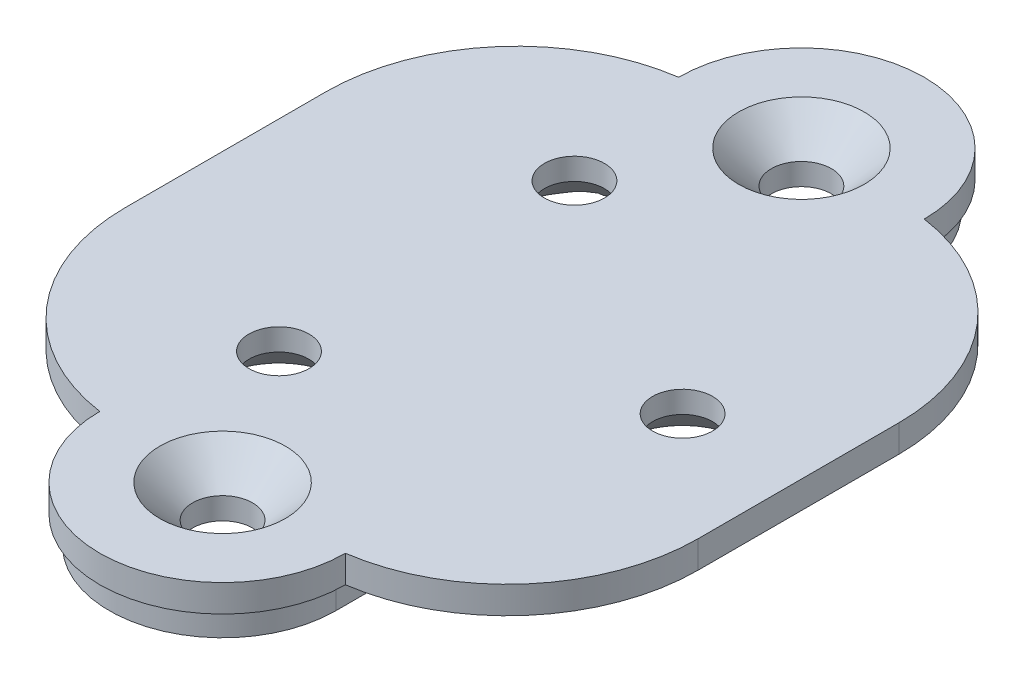
ISO-10303-21;
HEADER;
FILE_DESCRIPTION(('STEP AP214'),'2;1');
FILE_NAME('part.step','',(''),(''),'','','');
FILE_SCHEMA(('AUTOMOTIVE_DESIGN { 1 0 10303 214 1 1 1 1 }'));
ENDSEC;
DATA;
#1=APPLICATION_CONTEXT('core data for automotive mechanical design processes');
#2=APPLICATION_PROTOCOL_DEFINITION('international standard','automotive_design',2000,#1);
#3=PRODUCT_CONTEXT('',#1,'mechanical');
#4=PRODUCT('Part','Part','',(#3));
#5=PRODUCT_RELATED_PRODUCT_CATEGORY('part','',(#4));
#6=PRODUCT_DEFINITION_FORMATION('','',#4);
#7=PRODUCT_DEFINITION_CONTEXT('part definition',#1,'design');
#8=PRODUCT_DEFINITION('design','',#6,#7);
#9=PRODUCT_DEFINITION_SHAPE('','',#8);
#10=(LENGTH_UNIT() NAMED_UNIT(*) SI_UNIT(.MILLI.,.METRE.));
#11=(NAMED_UNIT(*) PLANE_ANGLE_UNIT() SI_UNIT($,.RADIAN.));
#12=(NAMED_UNIT(*) SI_UNIT($,.STERADIAN.) SOLID_ANGLE_UNIT());
#13=UNCERTAINTY_MEASURE_WITH_UNIT(LENGTH_MEASURE(1.E-05),#10,'distance_accuracy_value','');
#14=(GEOMETRIC_REPRESENTATION_CONTEXT(3) GLOBAL_UNCERTAINTY_ASSIGNED_CONTEXT((#13)) GLOBAL_UNIT_ASSIGNED_CONTEXT((#10,
#11,#12)) REPRESENTATION_CONTEXT('',''));
#15=CARTESIAN_POINT('',(0.,0.,0.));
#16=DIRECTION('',(0.,0.,1.));
#17=DIRECTION('',(1.,0.,0.));
#18=AXIS2_PLACEMENT_3D('',#15,#16,#17);
#19=CARTESIAN_POINT('',(0.,0.,0.));
#20=DIRECTION('',(0.,1.,0.));
#21=DIRECTION('',(0.,0.,1.));
#22=AXIS2_PLACEMENT_3D('',#19,#20,#21);
#23=PLANE('',#22);
#24=CARTESIAN_POINT('',(0.,0.,10.6041655099018));
#25=DIRECTION('',(0.,1.,0.));
#26=DIRECTION('',(0.,0.,1.));
#27=AXIS2_PLACEMENT_3D('',#24,#25,#26);
#28=CIRCLE('',#27,1.1);
#29=CARTESIAN_POINT('',(0.,0.,11.7041655099018));
#30=VERTEX_POINT('',#29);
#31=EDGE_CURVE('E382',#30,#30,#28,.T.);
#32=ORIENTED_EDGE('',*,*,#31,.T.);
#33=EDGE_LOOP('',(#32));
#34=FACE_BOUND('',#33,.T.);
#35=CARTESIAN_POINT('',(0.,0.,-10.6041655099018));
#36=DIRECTION('',(0.,1.,0.));
#37=DIRECTION('',(0.,0.,1.));
#38=AXIS2_PLACEMENT_3D('',#35,#36,#37);
#39=CIRCLE('',#38,1.1);
#40=CARTESIAN_POINT('',(0.,0.,-9.50416550990182));
#41=VERTEX_POINT('',#40);
#42=EDGE_CURVE('E390',#41,#41,#39,.T.);
#43=ORIENTED_EDGE('',*,*,#42,.T.);
#44=EDGE_LOOP('',(#43));
#45=FACE_BOUND('',#44,.T.);
#46=CARTESIAN_POINT('',(0.,0.,0.));
#47=DIRECTION('',(0.,-1.,0.));
#48=DIRECTION('',(0.,0.,-1.));
#49=AXIS2_PLACEMENT_3D('',#46,#47,#48);
#50=CIRCLE('',#49,8.4);
#51=CARTESIAN_POINT('',(4.15,0.,-7.30325269999608));
#52=VERTEX_POINT('',#51);
#53=CARTESIAN_POINT('',(8.3466,0.,-0.945657675906018));
#54=VERTEX_POINT('',#53);
#55=EDGE_CURVE('E194',#52,#54,#50,.T.);
#56=ORIENTED_EDGE('',*,*,#55,.T.);
#57=CARTESIAN_POINT('',(6.25,0.,0.));
#58=DIRECTION('',(0.,-1.,0.));
#59=DIRECTION('',(0.,0.,-1.));
#60=AXIS2_PLACEMENT_3D('',#57,#58,#59);
#61=CIRCLE('',#60,2.3);
#62=CARTESIAN_POINT('',(8.34660000000001,0.,0.945657675906021));
#63=VERTEX_POINT('',#62);
#64=EDGE_CURVE('E423',#63,#54,#61,.T.);
#65=ORIENTED_EDGE('',*,*,#64,.F.);
#66=CARTESIAN_POINT('',(4.15,0.,7.30325269999608));
#67=VERTEX_POINT('',#66);
#68=EDGE_CURVE('E53',#63,#67,#50,.T.);
#69=ORIENTED_EDGE('',*,*,#68,.T.);
#70=DIRECTION('',(0.,0.,1.));
#71=VECTOR('',#70,1.);
#72=CARTESIAN_POINT('',(4.15,0.,7.30325269999608));
#73=LINE('',#72,#71);
#74=CARTESIAN_POINT('',(4.15,0.,10.6041655099018));
#75=VERTEX_POINT('',#74);
#76=EDGE_CURVE('E174',#67,#75,#73,.T.);
#77=ORIENTED_EDGE('',*,*,#76,.T.);
#78=CARTESIAN_POINT('',(0.,0.,10.6041655099018));
#79=DIRECTION('',(0.,-1.,0.));
#80=DIRECTION('',(0.,0.,-1.));
#81=AXIS2_PLACEMENT_3D('',#78,#79,#80);
#82=CIRCLE('',#81,4.15);
#83=CARTESIAN_POINT('',(-4.15,0.,10.6041655099018));
#84=VERTEX_POINT('',#83);
#85=EDGE_CURVE('E176',#75,#84,#82,.T.);
#86=ORIENTED_EDGE('',*,*,#85,.T.);
#87=DIRECTION('',(0.,0.,-1.));
#88=VECTOR('',#87,1.);
#89=CARTESIAN_POINT('',(-4.15,0.,10.6041655099018));
#90=LINE('',#89,#88);
#91=CARTESIAN_POINT('',(-4.15,0.,7.47163303284104));
#92=VERTEX_POINT('',#91);
#93=EDGE_CURVE('E232',#84,#92,#90,.T.);
#94=ORIENTED_EDGE('',*,*,#93,.T.);
#95=CARTESIAN_POINT('',(-3.12499999999999,0.,5.41265877365275));
#96=DIRECTION('',(0.,-1.,0.));
#97=DIRECTION('',(0.,0.,-1.));
#98=AXIS2_PLACEMENT_3D('',#95,#96,#97);
#99=CIRCLE('',#98,2.3);
#100=CARTESIAN_POINT('',(-4.99226357061835,0.,6.7555387972742));
#101=VERTEX_POINT('',#100);
#102=EDGE_CURVE('E405',#101,#92,#99,.T.);
#103=ORIENTED_EDGE('',*,*,#102,.F.);
#104=CARTESIAN_POINT('',(0.,0.,0.));
#105=DIRECTION('',(0.,-1.,0.));
#106=DIRECTION('',(0.,0.,-1.));
#107=AXIS2_PLACEMENT_3D('',#104,#105,#106);
#108=CIRCLE('',#107,8.4);
#109=CARTESIAN_POINT('',(-4.99226357061835,0.,-6.7555387972742));
#110=VERTEX_POINT('',#109);
#111=EDGE_CURVE('E229',#101,#110,#108,.T.);
#112=ORIENTED_EDGE('',*,*,#111,.T.);
#113=CARTESIAN_POINT('',(-3.12499999999999,0.,-5.41265877365275));
#114=DIRECTION('',(0.,-1.,0.));
#115=DIRECTION('',(0.,0.,-1.));
#116=AXIS2_PLACEMENT_3D('',#113,#114,#115);
#117=CIRCLE('',#116,2.3);
#118=CARTESIAN_POINT('',(-4.15,0.,-7.47163303284104));
#119=VERTEX_POINT('',#118);
#120=EDGE_CURVE('E414',#119,#110,#117,.T.);
#121=ORIENTED_EDGE('',*,*,#120,.F.);
#122=DIRECTION('',(0.,0.,-1.));
#123=VECTOR('',#122,1.);
#124=CARTESIAN_POINT('',(-4.15,0.,-7.30325269999608));
#125=LINE('',#124,#123);
#126=CARTESIAN_POINT('',(-4.15,0.,-10.6041655099018));
#127=VERTEX_POINT('',#126);
#128=EDGE_CURVE('E225',#119,#127,#125,.T.);
#129=ORIENTED_EDGE('',*,*,#128,.T.);
#130=CARTESIAN_POINT('',(0.,0.,-10.6041655099018));
#131=DIRECTION('',(0.,-1.,0.));
#132=DIRECTION('',(0.,0.,-1.));
#133=AXIS2_PLACEMENT_3D('',#130,#131,#132);
#134=CIRCLE('',#133,4.15);
#135=CARTESIAN_POINT('',(4.15,0.,-10.6041655099018));
#136=VERTEX_POINT('',#135);
#137=EDGE_CURVE('E221',#127,#136,#134,.T.);
#138=ORIENTED_EDGE('',*,*,#137,.T.);
#139=DIRECTION('',(0.,0.,1.));
#140=VECTOR('',#139,1.);
#141=CARTESIAN_POINT('',(4.15,0.,-10.6041655099018));
#142=LINE('',#141,#140);
#143=EDGE_CURVE('E218',#136,#52,#142,.T.);
#144=ORIENTED_EDGE('',*,*,#143,.T.);
#145=EDGE_LOOP('',(#56,#65,#69,#77,#86,#94,#103,#112,#121,#129,#138,#144));
#146=FACE_BOUND('',#145,.T.);
#147=ADVANCED_FACE('F33',(#34,#45,#146),#23,.F.);
#148=CARTESIAN_POINT('',(-3.12499999999999,0.,5.41265877365275));
#149=DIRECTION('',(0.,-1.,0.));
#150=DIRECTION('',(0.,0.,-1.));
#151=AXIS2_PLACEMENT_3D('',#148,#149,#150);
#152=CONICAL_SURFACE('',#151,2.3,0.785398163397455);
#153=CARTESIAN_POINT('',(-3.12499999999999,1.19999999999999,5.41265877365275));
#154=DIRECTION('',(0.,-1.,0.));
#155=DIRECTION('',(0.,0.,-1.));
#156=AXIS2_PLACEMENT_3D('',#153,#154,#155);
#157=CIRCLE('',#156,1.09999999999999);
#158=CARTESIAN_POINT('',(-3.12499999999999,1.19999999999999,4.31265877365276));
#159=VERTEX_POINT('',#158);
#160=EDGE_CURVE('E402',#159,#159,#157,.T.);
#161=ORIENTED_EDGE('',*,*,#160,.F.);
#162=EDGE_LOOP('',(#161));
#163=FACE_BOUND('',#162,.T.);
#164=CARTESIAN_POINT('',(-4.99278917763485,-0.000200000000061499,6.75515034826704));
#165=CARTESIAN_POINT('',(-4.92715198670171,0.0248100631838858,6.80367058612201));
#166=CARTESIAN_POINT('',(-4.86011425174692,0.0472295339260996,6.85173200169083));
#167=CARTESIAN_POINT('',(-4.72397796758234,0.0858821322138904,6.94628151619377));
#168=CARTESIAN_POINT('',(-4.65489792935854,0.102159021983192,6.99277850884145));
#169=CARTESIAN_POINT('',(-4.5143933624049,0.127920925551719,7.08429850334942));
#170=CARTESIAN_POINT('',(-4.44296678533144,0.13739983112156,7.12932014498418));
#171=CARTESIAN_POINT('',(-4.33425856189755,0.146116604762799,7.19555589053189));
#172=CARTESIAN_POINT('',(-4.29762174729584,0.148102261529235,7.21749758253535));
#173=CARTESIAN_POINT('',(-4.22397358602387,0.150184179206707,7.26084531213115));
#174=CARTESIAN_POINT('',(-4.18696219449155,0.150280211057864,7.28225128446958));
#175=CARTESIAN_POINT('',(-4.14979999999992,0.149420971471217,7.30336634436481));
#176=B_SPLINE_CURVE_WITH_KNOTS('',3,(#164,#165,#166,#167,#168,#169,#170,#171,#172,#173,#174,
#175),.UNSPECIFIED.,.F.,.F.,(4,2,2,2,2,4),(0.,0.256139644494165,0.5104183582001,
0.764925265041134,0.893136897085683,1.02136407081771),.UNSPECIFIED.);
#177=CARTESIAN_POINT('',(-4.15,0.149425566429672,7.30325269999608));
#178=VERTEX_POINT('',#177);
#179=EDGE_CURVE('E200',#101,#178,#176,.T.);
#180=ORIENTED_EDGE('',*,*,#179,.F.);
#181=ORIENTED_EDGE('',*,*,#102,.T.);
#182=CARTESIAN_POINT('',(-4.15,0.868212410657697,6.41235407773023));
#183=CARTESIAN_POINT('',(-4.15,0.838635516505296,6.45468745235044));
#184=CARTESIAN_POINT('',(-4.15,0.808442067134203,6.49658092804831));
#185=CARTESIAN_POINT('',(-4.15,0.747058812831585,6.57961975471023));
#186=CARTESIAN_POINT('',(-4.15,0.715869210071513,6.62076525485086));
#187=CARTESIAN_POINT('',(-4.15,0.65273762083587,6.70243175693539));
#188=CARTESIAN_POINT('',(-4.15,0.620796106722267,6.74295312582206));
#189=CARTESIAN_POINT('',(-4.15,0.556291415118948,6.82350101667112));
#190=CARTESIAN_POINT('',(-4.15,0.523728201471161,6.86352750962707));
#191=CARTESIAN_POINT('',(-4.15,0.425360384583194,6.98291108139938));
#192=CARTESIAN_POINT('',(-4.15,0.35881253934147,7.06165535963236));
#193=CARTESIAN_POINT('',(-4.15,0.224358529488972,7.21799492669198));
#194=CARTESIAN_POINT('',(-4.15,0.156452102870568,7.2955899887673));
#195=CARTESIAN_POINT('',(-4.15,-0.0317357135467273,7.50797094387607));
#196=CARTESIAN_POINT('',(-4.15,-0.153001253049908,7.64188346556477));
#197=CARTESIAN_POINT('',(-4.15,-0.397250150436154,7.90811285690661));
#198=CARTESIAN_POINT('',(-4.15,-0.520233443537888,8.04042978638523));
#199=CARTESIAN_POINT('',(-4.15,-0.767513488372292,8.30422322777691));
#200=CARTESIAN_POINT('',(-4.15,-0.891812012622755,8.43569807569894));
#201=CARTESIAN_POINT('',(-4.15,-1.14119359432511,8.69788891918938));
#202=CARTESIAN_POINT('',(-4.15,-1.26627660974399,8.82860495470442));
#203=CARTESIAN_POINT('',(-4.15,-1.39159014935979,8.95909541214642));
#204=B_SPLINE_CURVE_WITH_KNOTS('',3,(#182,#183,#184,#185,#186,#187,#188,#189,#190,#191,#192,
#193,#194,#195,#196,#197,#198,#199,#200,#201,#202,#203),.UNSPECIFIED.,.F.,.F.,(4,2,2,2,2,2,2,2,
2,2,4),(0.,0.15490998689401,0.309788731795426,0.464572647559042,0.619365593151983,
0.928634945756171,1.2379645283185,1.7799128585347,2.32184080524199,2.86462750096266,
3.40738535849262),.UNSPECIFIED.);
#205=EDGE_CURVE('E11',#178,#92,#204,.T.);
#206=ORIENTED_EDGE('',*,*,#205,.F.);
#207=EDGE_LOOP('',(#180,#181,#206));
#208=FACE_BOUND('',#207,.T.);
#209=ADVANCED_FACE('F243',(#163,#208),#152,.F.);
#210=CARTESIAN_POINT('',(-3.12499999999999,0.,-5.41265877365275));
#211=DIRECTION('',(0.,-1.,0.));
#212=DIRECTION('',(0.,0.,-1.));
#213=AXIS2_PLACEMENT_3D('',#210,#211,#212);
#214=CONICAL_SURFACE('',#213,2.3,0.785398163397455);
#215=CARTESIAN_POINT('',(-3.12499999999999,1.19999999999999,-5.41265877365275));
#216=DIRECTION('',(0.,-1.,0.));
#217=DIRECTION('',(0.,0.,-1.));
#218=AXIS2_PLACEMENT_3D('',#215,#216,#217);
#219=CIRCLE('',#218,1.09999999999999);
#220=CARTESIAN_POINT('',(-3.12499999999999,1.19999999999999,-6.51265877365274));
#221=VERTEX_POINT('',#220);
#222=EDGE_CURVE('E411',#221,#221,#219,.T.);
#223=ORIENTED_EDGE('',*,*,#222,.F.);
#224=EDGE_LOOP('',(#223));
#225=FACE_BOUND('',#224,.T.);
#226=CARTESIAN_POINT('',(-4.15,-1.39159014935979,-8.95909541214643));
#227=CARTESIAN_POINT('',(-4.15,-1.26627660974399,-8.82860495470442));
#228=CARTESIAN_POINT('',(-4.15,-1.14119359432511,-8.69788891918939));
#229=CARTESIAN_POINT('',(-4.15,-0.891812012622754,-8.43569807569894));
#230=CARTESIAN_POINT('',(-4.15,-0.767513488372291,-8.30422322777692));
#231=CARTESIAN_POINT('',(-4.15,-0.520233443537887,-8.04042978638523));
#232=CARTESIAN_POINT('',(-4.15,-0.397250150436153,-7.90811285690661));
#233=CARTESIAN_POINT('',(-4.15,-0.153001253049907,-7.64188346556477));
#234=CARTESIAN_POINT('',(-4.15,-0.0317357135467267,-7.50797094387607));
#235=CARTESIAN_POINT('',(-4.15,0.156452102870568,-7.2955899887673));
#236=CARTESIAN_POINT('',(-4.15,0.224358529488972,-7.21799492669198));
#237=CARTESIAN_POINT('',(-4.15,0.358812539341468,-7.06165535963237));
#238=CARTESIAN_POINT('',(-4.15,0.425360384583191,-6.98291108139939));
#239=CARTESIAN_POINT('',(-4.15,0.523728201471157,-6.86352750962708));
#240=CARTESIAN_POINT('',(-4.15,0.556291415118944,-6.82350101667113));
#241=CARTESIAN_POINT('',(-4.15,0.620796106722262,-6.74295312582207));
#242=CARTESIAN_POINT('',(-4.15,0.652737620835865,-6.70243175693539));
#243=CARTESIAN_POINT('',(-4.15,0.715869210071508,-6.62076525485087));
#244=CARTESIAN_POINT('',(-4.15,0.74705881283158,-6.57961975471023));
#245=CARTESIAN_POINT('',(-4.15,0.808442067134197,-6.49658092804832));
#246=CARTESIAN_POINT('',(-4.15,0.83863551650529,-6.45468745235045));
#247=CARTESIAN_POINT('',(-4.15,0.868212410657691,-6.41235407773024));
#248=B_SPLINE_CURVE_WITH_KNOTS('',3,(#226,#227,#228,#229,#230,#231,#232,#233,#234,#235,#236,
#237,#238,#239,#240,#241,#242,#243,#244,#245,#246,#247),.UNSPECIFIED.,.F.,.F.,(4,2,2,2,2,2,2,2,
2,2,4),(0.,0.542757857529956,1.08554455325062,1.62747249995792,2.16942083017412,
2.47875041273644,2.78801976534063,2.94281271093357,3.09759662669718,3.2524753715986,
3.40738535849261),.UNSPECIFIED.);
#249=CARTESIAN_POINT('',(-4.15,0.149425566429673,-7.30325269999608));
#250=VERTEX_POINT('',#249);
#251=EDGE_CURVE('E46',#119,#250,#248,.T.);
#252=ORIENTED_EDGE('',*,*,#251,.F.);
#253=ORIENTED_EDGE('',*,*,#120,.T.);
#254=CARTESIAN_POINT('',(-4.14979999999992,0.149420971471218,-7.30336634436482));
#255=CARTESIAN_POINT('',(-4.18696219449155,0.150280211057864,-7.28225128446958));
#256=CARTESIAN_POINT('',(-4.22397358602387,0.150184179206707,-7.26084531213115));
#257=CARTESIAN_POINT('',(-4.29762174729584,0.148102261529237,-7.21749758253535));
#258=CARTESIAN_POINT('',(-4.33425856189755,0.146116604762801,-7.19555589053189));
#259=CARTESIAN_POINT('',(-4.44296678533143,0.137399831121562,-7.12932014498418));
#260=CARTESIAN_POINT('',(-4.5143933624049,0.12792092555172,-7.08429850334943));
#261=CARTESIAN_POINT('',(-4.65489792935854,0.102159021983192,-6.99277850884145));
#262=CARTESIAN_POINT('',(-4.72397796758234,0.0858821322138897,-6.94628151619377));
#263=CARTESIAN_POINT('',(-4.86011425174692,0.0472295339260988,-6.85173200169083));
#264=CARTESIAN_POINT('',(-4.92715198670171,0.0248100631838853,-6.80367058612201));
#265=CARTESIAN_POINT('',(-4.99278917763485,-0.000200000000061046,-6.75515034826704));
#266=B_SPLINE_CURVE_WITH_KNOTS('',3,(#254,#255,#256,#257,#258,#259,#260,#261,#262,#263,#264,
#265),.UNSPECIFIED.,.F.,.F.,(4,2,2,2,2,4),(0.,0.128227173732023,0.256438805776574,
0.510945712617607,0.765224426323541,1.02136407081771),.UNSPECIFIED.);
#267=EDGE_CURVE('E260',#250,#110,#266,.T.);
#268=ORIENTED_EDGE('',*,*,#267,.F.);
#269=EDGE_LOOP('',(#252,#253,#268));
#270=FACE_BOUND('',#269,.T.);
#271=ADVANCED_FACE('F276',(#225,#270),#214,.F.);
#272=CARTESIAN_POINT('',(6.25,0.,0.));
#273=DIRECTION('',(0.,-1.,0.));
#274=DIRECTION('',(0.,0.,-1.));
#275=AXIS2_PLACEMENT_3D('',#272,#273,#274);
#276=CONICAL_SURFACE('',#275,2.3,0.785398163397455);
#277=CARTESIAN_POINT('',(6.25,1.19999999999999,0.));
#278=DIRECTION('',(0.,-1.,0.));
#279=DIRECTION('',(0.,0.,-1.));
#280=AXIS2_PLACEMENT_3D('',#277,#278,#279);
#281=CIRCLE('',#280,1.09999999999999);
#282=CARTESIAN_POINT('',(6.25,1.19999999999999,-1.09999999999999));
#283=VERTEX_POINT('',#282);
#284=EDGE_CURVE('E420',#283,#283,#281,.T.);
#285=ORIENTED_EDGE('',*,*,#284,.F.);
#286=EDGE_LOOP('',(#285));
#287=FACE_BOUND('',#286,.T.);
#288=CARTESIAN_POINT('',(7.99940268198013,-0.803218728231761,2.56311465438617));
#289=CARTESIAN_POINT('',(8.01901973062119,-0.763712098221157,2.50188639853172));
#290=CARTESIAN_POINT('',(8.03802420179341,-0.724678367905175,2.44015925728474));
#291=CARTESIAN_POINT('',(8.07478411273328,-0.647740918936234,2.31561704365371));
#292=CARTESIAN_POINT('',(8.0925392496951,-0.609837475509088,2.25280171208696));
#293=CARTESIAN_POINT('',(8.14406168867552,-0.497734337328274,2.06196372954792));
#294=CARTESIAN_POINT('',(8.17587822807902,-0.425563112680702,1.93219388866401));
#295=CARTESIAN_POINT('',(8.23484419992085,-0.286869780285497,1.66338772474935));
#296=CARTESIAN_POINT('',(8.26182281385857,-0.220585396385035,1.52418972641715));
#297=CARTESIAN_POINT('',(8.30925198461296,-0.100098504213216,1.23977125402815));
#298=CARTESIAN_POINT('',(8.32971728446831,-0.0458687950996659,1.09456523410996));
#299=CARTESIAN_POINT('',(8.35619604372874,0.0260715315098679,0.861019783065302));
#300=CARTESIAN_POINT('',(8.36465576095872,0.049510028869555,0.774722447430933));
#301=CARTESIAN_POINT('',(8.37897689492112,0.0896398723889784,0.600328637566321));
#302=CARTESIAN_POINT('',(8.38483832503197,0.106331253289116,0.512232172602115));
#303=CARTESIAN_POINT('',(8.39374821804879,0.131864489927603,0.335726896814049));
#304=CARTESIAN_POINT('',(8.39682643835329,0.140789343793036,0.247331785271671));
#305=CARTESIAN_POINT('',(8.40017545074915,0.150504032227429,0.0700442376169418));
#306=CARTESIAN_POINT('',(8.40044678609277,0.151295440965615,-0.0188480989287381));
#307=CARTESIAN_POINT('',(8.39840064041202,0.14535506851692,-0.178711387133715));
#308=CARTESIAN_POINT('',(8.39658479846534,0.140080954340669,-0.249747989194564));
#309=CARTESIAN_POINT('',(8.39118408612384,0.124509274329148,-0.391201211293811));
#310=CARTESIAN_POINT('',(8.38759911600649,0.11421142531544,-0.461617796155195));
#311=CARTESIAN_POINT('',(8.37871218577833,0.0889468167242237,-0.601775555188137));
#312=CARTESIAN_POINT('',(8.37340354318281,0.0739618943173351,-0.671512994631882));
#313=CARTESIAN_POINT('',(8.36116150526844,0.0398511067983217,-0.809815004097171));
#314=CARTESIAN_POINT('',(8.3542279444039,0.0207248197816066,-0.878379453851045));
#315=CARTESIAN_POINT('',(8.33041894048237,-0.0439633626280181,-1.08837482429491));
#316=CARTESIAN_POINT('',(8.31095216213957,-0.0955938542316042,-1.22765701124195));
#317=CARTESIAN_POINT('',(8.26604129807372,-0.21003184466273,-1.50058197251466));
#318=CARTESIAN_POINT('',(8.2405893488314,-0.272854020951852,-1.63421705263638));
#319=CARTESIAN_POINT('',(8.18414493921036,-0.406506062786883,-1.89680315916593));
#320=CARTESIAN_POINT('',(8.1531322575439,-0.47736479515948,-2.02573495106415));
#321=CARTESIAN_POINT('',(8.08600911070525,-0.624517858480624,-2.27894710953865));
#322=CARTESIAN_POINT('',(8.04990151960078,-0.700809112975062,-2.40323004889502));
#323=CARTESIAN_POINT('',(7.97766939526602,-0.847428445300692,-2.63236622193731));
#324=CARTESIAN_POINT('',(7.94211867166273,-0.917298965629626,-2.73769652692426));
#325=CARTESIAN_POINT('',(7.86769230566879,-1.0587732024576,-2.94472181029001));
#326=CARTESIAN_POINT('',(7.82884396551999,-1.13035972580474,-3.04643832245323));
#327=CARTESIAN_POINT('',(7.78827247654394,-1.20272665836211,-3.14687334208228));
#328=B_SPLINE_CURVE_WITH_KNOTS('',3,(#288,#289,#290,#291,#292,#293,#294,#295,#296,#297,#298,
#299,#300,#301,#302,#303,#304,#305,#306,#307,#308,#309,#310,#311,#312,#313,#314,#315,#316,#317,
#318,#319,#320,#321,#322,#323,#324,#325,#326,#327),.UNSPECIFIED.,.F.,.F.,(4,2,2,2,2,2,2,2,2,2,2,
2,2,2,2,2,2,2,2,4),(0.,0.226373642691225,0.452801964757162,0.908048674976562,1.37710279906582,
1.84508752998397,2.11430145554731,2.38351399493048,2.64981292249666,2.91606030886885,
3.12962388177167,3.34319949424071,3.55761320479847,3.77204876919797,4.22053155008237,
4.6696068877125,5.12034966387739,5.57083918247501,5.96464461993724,6.35545922993768),.UNSPECIFIED.);
#329=EDGE_CURVE('E266',#63,#54,#328,.T.);
#330=ORIENTED_EDGE('',*,*,#329,.F.);
#331=ORIENTED_EDGE('',*,*,#64,.T.);
#332=EDGE_LOOP('',(#330,#331));
#333=FACE_BOUND('',#332,.T.);
#334=ADVANCED_FACE('F280',(#287,#333),#276,.F.);
#335=CARTESIAN_POINT('',(0.,2.,-10.6041655099018));
#336=DIRECTION('',(0.,-1.,0.));
#337=DIRECTION('',(0.,0.,-1.));
#338=AXIS2_PLACEMENT_3D('',#335,#336,#337);
#339=CYLINDRICAL_SURFACE('',#338,4.5);
#340=DIRECTION('',(0.,-1.,0.));
#341=VECTOR('',#340,1.);
#342=CARTESIAN_POINT('',(4.5,2.,-10.6041655099018));
#343=LINE('',#342,#341);
#344=CARTESIAN_POINT('',(4.5,2.,-10.6041655099018));
#345=VERTEX_POINT('',#344);
#346=CARTESIAN_POINT('',(4.5,1.,-10.6041655099018));
#347=VERTEX_POINT('',#346);
#348=EDGE_CURVE('E366',#345,#347,#343,.T.);
#349=ORIENTED_EDGE('',*,*,#348,.T.);
#350=CARTESIAN_POINT('',(0.,1.,-10.6041655099018));
#351=DIRECTION('',(0.,1.,0.));
#352=DIRECTION('',(0.,0.,1.));
#353=AXIS2_PLACEMENT_3D('',#350,#351,#352);
#354=CIRCLE('',#353,4.5);
#355=CARTESIAN_POINT('',(-4.5,1.,-10.6041655099018));
#356=VERTEX_POINT('',#355);
#357=EDGE_CURVE('E211',#356,#347,#354,.F.);
#358=ORIENTED_EDGE('',*,*,#357,.F.);
#359=DIRECTION('',(0.,-1.,0.));
#360=VECTOR('',#359,1.);
#361=CARTESIAN_POINT('',(-4.5,2.,-10.6041655099018));
#362=LINE('',#361,#360);
#363=CARTESIAN_POINT('',(-4.5,2.,-10.6041655099018));
#364=VERTEX_POINT('',#363);
#365=EDGE_CURVE('E369',#364,#356,#362,.T.);
#366=ORIENTED_EDGE('',*,*,#365,.F.);
#367=CARTESIAN_POINT('',(0.,2.,-10.6041655099018));
#368=DIRECTION('',(0.,1.,0.));
#369=DIRECTION('',(0.,0.,1.));
#370=AXIS2_PLACEMENT_3D('',#367,#368,#369);
#371=CIRCLE('',#370,4.5);
#372=EDGE_CURVE('E379',#345,#364,#371,.T.);
#373=ORIENTED_EDGE('',*,*,#372,.F.);
#374=EDGE_LOOP('',(#349,#358,#366,#373));
#375=FACE_BOUND('',#374,.T.);
#376=ADVANCED_FACE('F314',(#375),#339,.T.);
#377=CARTESIAN_POINT('',(0.,2.,10.6041655099018));
#378=DIRECTION('',(0.,-1.,0.));
#379=DIRECTION('',(0.,0.,-1.));
#380=AXIS2_PLACEMENT_3D('',#377,#378,#379);
#381=CYLINDRICAL_SURFACE('',#380,4.5);
#382=DIRECTION('',(0.,-1.,0.));
#383=VECTOR('',#382,1.);
#384=CARTESIAN_POINT('',(-4.5,2.,10.6041655099018));
#385=LINE('',#384,#383);
#386=CARTESIAN_POINT('',(-4.5,2.,10.6041655099018));
#387=VERTEX_POINT('',#386);
#388=CARTESIAN_POINT('',(-4.5,1.,10.6041655099018));
#389=VERTEX_POINT('',#388);
#390=EDGE_CURVE('E372',#387,#389,#385,.T.);
#391=ORIENTED_EDGE('',*,*,#390,.T.);
#392=CARTESIAN_POINT('',(0.,1.,10.6041655099018));
#393=DIRECTION('',(0.,1.,0.));
#394=DIRECTION('',(0.,0.,1.));
#395=AXIS2_PLACEMENT_3D('',#392,#393,#394);
#396=CIRCLE('',#395,4.5);
#397=CARTESIAN_POINT('',(4.5,1.,10.6041655099018));
#398=VERTEX_POINT('',#397);
#399=EDGE_CURVE('E213',#398,#389,#396,.F.);
#400=ORIENTED_EDGE('',*,*,#399,.F.);
#401=DIRECTION('',(0.,-1.,0.));
#402=VECTOR('',#401,1.);
#403=CARTESIAN_POINT('',(4.5,2.,10.6041655099018));
#404=LINE('',#403,#402);
#405=CARTESIAN_POINT('',(4.5,2.,10.6041655099018));
#406=VERTEX_POINT('',#405);
#407=EDGE_CURVE('E341',#406,#398,#404,.T.);
#408=ORIENTED_EDGE('',*,*,#407,.F.);
#409=CARTESIAN_POINT('',(0.,2.,10.6041655099018));
#410=DIRECTION('',(0.,1.,0.));
#411=DIRECTION('',(0.,0.,1.));
#412=AXIS2_PLACEMENT_3D('',#409,#410,#411);
#413=CIRCLE('',#412,4.5);
#414=EDGE_CURVE('E376',#387,#406,#413,.T.);
#415=ORIENTED_EDGE('',*,*,#414,.F.);
#416=EDGE_LOOP('',(#391,#400,#408,#415));
#417=FACE_BOUND('',#416,.T.);
#418=ADVANCED_FACE('F311',(#417),#381,.T.);
#419=CARTESIAN_POINT('',(0.,2.,0.));
#420=DIRECTION('',(0.,1.,0.));
#421=DIRECTION('',(0.,0.,1.));
#422=AXIS2_PLACEMENT_3D('',#419,#420,#421);
#423=PLANE('',#422);
#424=ORIENTED_EDGE('',*,*,#372,.T.);
#425=CARTESIAN_POINT('',(-3.49999999999999,2.,-3.67596227962631));
#426=DIRECTION('',(0.,1.,0.));
#427=DIRECTION('',(0.,0.,1.));
#428=AXIS2_PLACEMENT_3D('',#425,#426,#427);
#429=CIRCLE('',#428,7.);
#430=CARTESIAN_POINT('',(-10.5,2.,-3.67596227962631));
#431=VERTEX_POINT('',#430);
#432=EDGE_CURVE('E358',#364,#431,#429,.T.);
#433=ORIENTED_EDGE('',*,*,#432,.T.);
#434=DIRECTION('',(0.,0.,1.));
#435=VECTOR('',#434,1.);
#436=CARTESIAN_POINT('',(-10.5,2.,-10.6041655099018));
#437=LINE('',#436,#435);
#438=CARTESIAN_POINT('',(-10.5,2.,3.67596227962631));
#439=VERTEX_POINT('',#438);
#440=EDGE_CURVE('E240',#431,#439,#437,.T.);
#441=ORIENTED_EDGE('',*,*,#440,.T.);
#442=CARTESIAN_POINT('',(-3.49999999999999,2.,3.67596227962631));
#443=DIRECTION('',(0.,1.,0.));
#444=DIRECTION('',(0.,0.,1.));
#445=AXIS2_PLACEMENT_3D('',#442,#443,#444);
#446=CIRCLE('',#445,7.);
#447=EDGE_CURVE('E360',#439,#387,#446,.T.);
#448=ORIENTED_EDGE('',*,*,#447,.T.);
#449=ORIENTED_EDGE('',*,*,#414,.T.);
#450=CARTESIAN_POINT('',(3.5,2.,3.67596227962631));
#451=DIRECTION('',(0.,1.,0.));
#452=DIRECTION('',(0.,0.,1.));
#453=AXIS2_PLACEMENT_3D('',#450,#451,#452);
#454=CIRCLE('',#453,7.);
#455=CARTESIAN_POINT('',(10.5,2.,3.67596227962631));
#456=VERTEX_POINT('',#455);
#457=EDGE_CURVE('E362',#406,#456,#454,.T.);
#458=ORIENTED_EDGE('',*,*,#457,.T.);
#459=DIRECTION('',(0.,0.,-1.));
#460=VECTOR('',#459,1.);
#461=CARTESIAN_POINT('',(10.5,2.,-10.6041655099018));
#462=LINE('',#461,#460);
#463=CARTESIAN_POINT('',(10.5,2.,-3.67596227962631));
#464=VERTEX_POINT('',#463);
#465=EDGE_CURVE('E427',#456,#464,#462,.T.);
#466=ORIENTED_EDGE('',*,*,#465,.T.);
#467=CARTESIAN_POINT('',(3.5,2.,-3.67596227962631));
#468=DIRECTION('',(0.,1.,0.));
#469=DIRECTION('',(0.,0.,1.));
#470=AXIS2_PLACEMENT_3D('',#467,#468,#469);
#471=CIRCLE('',#470,7.);
#472=EDGE_CURVE('E364',#464,#345,#471,.T.);
#473=ORIENTED_EDGE('',*,*,#472,.T.);
#474=EDGE_LOOP('',(#424,#433,#441,#448,#449,#458,#466,#473));
#475=FACE_BOUND('',#474,.T.);
#476=CARTESIAN_POINT('',(6.25,2.,0.));
#477=DIRECTION('',(0.,-1.,0.));
#478=DIRECTION('',(0.,0.,-1.));
#479=AXIS2_PLACEMENT_3D('',#476,#477,#478);
#480=CIRCLE('',#479,1.1);
#481=CARTESIAN_POINT('',(6.25,2.,-1.1));
#482=VERTEX_POINT('',#481);
#483=EDGE_CURVE('E417',#482,#482,#480,.T.);
#484=ORIENTED_EDGE('',*,*,#483,.T.);
#485=EDGE_LOOP('',(#484));
#486=FACE_BOUND('',#485,.T.);
#487=CARTESIAN_POINT('',(-3.12499999999999,2.,-5.41265877365275));
#488=DIRECTION('',(0.,-1.,0.));
#489=DIRECTION('',(0.,0.,-1.));
#490=AXIS2_PLACEMENT_3D('',#487,#488,#489);
#491=CIRCLE('',#490,1.1);
#492=CARTESIAN_POINT('',(-3.12499999999999,2.,-6.51265877365275));
#493=VERTEX_POINT('',#492);
#494=EDGE_CURVE('E408',#493,#493,#491,.T.);
#495=ORIENTED_EDGE('',*,*,#494,.T.);
#496=EDGE_LOOP('',(#495));
#497=FACE_BOUND('',#496,.T.);
#498=CARTESIAN_POINT('',(-3.12499999999999,2.,5.41265877365275));
#499=DIRECTION('',(0.,-1.,0.));
#500=DIRECTION('',(0.,0.,-1.));
#501=AXIS2_PLACEMENT_3D('',#498,#499,#500);
#502=CIRCLE('',#501,1.1);
#503=CARTESIAN_POINT('',(-3.12499999999999,2.,4.31265877365275));
#504=VERTEX_POINT('',#503);
#505=EDGE_CURVE('E399',#504,#504,#502,.T.);
#506=ORIENTED_EDGE('',*,*,#505,.T.);
#507=EDGE_LOOP('',(#506));
#508=FACE_BOUND('',#507,.T.);
#509=CARTESIAN_POINT('',(0.,2.,-10.6041655099018));
#510=DIRECTION('',(0.,1.,0.));
#511=DIRECTION('',(0.,0.,1.));
#512=AXIS2_PLACEMENT_3D('',#509,#510,#511);
#513=CIRCLE('',#512,2.3);
#514=CARTESIAN_POINT('',(0.,2.,-8.30416550990182));
#515=VERTEX_POINT('',#514);
#516=EDGE_CURVE('E396',#515,#515,#513,.T.);
#517=ORIENTED_EDGE('',*,*,#516,.F.);
#518=EDGE_LOOP('',(#517));
#519=FACE_BOUND('',#518,.T.);
#520=CARTESIAN_POINT('',(0.,2.,10.6041655099018));
#521=DIRECTION('',(0.,1.,0.));
#522=DIRECTION('',(0.,0.,1.));
#523=AXIS2_PLACEMENT_3D('',#520,#521,#522);
#524=CIRCLE('',#523,2.3);
#525=CARTESIAN_POINT('',(0.,2.,12.9041655099018));
#526=VERTEX_POINT('',#525);
#527=EDGE_CURVE('E387',#526,#526,#524,.T.);
#528=ORIENTED_EDGE('',*,*,#527,.F.);
#529=EDGE_LOOP('',(#528));
#530=FACE_BOUND('',#529,.T.);
#531=ADVANCED_FACE('F309',(#475,#486,#497,#508,#519,#530),#423,.T.);
#532=CARTESIAN_POINT('',(0.,2.,10.6041655099018));
#533=DIRECTION('',(0.,1.,0.));
#534=DIRECTION('',(0.,0.,1.));
#535=AXIS2_PLACEMENT_3D('',#532,#533,#534);
#536=CYLINDRICAL_SURFACE('',#535,1.1);
#537=ORIENTED_EDGE('',*,*,#31,.F.);
#538=EDGE_LOOP('',(#537));
#539=FACE_BOUND('',#538,.T.);
#540=CARTESIAN_POINT('',(0.,0.8,10.6041655099018));
#541=DIRECTION('',(0.,1.,0.));
#542=DIRECTION('',(0.,0.,1.));
#543=AXIS2_PLACEMENT_3D('',#540,#541,#542);
#544=CIRCLE('',#543,1.1);
#545=CARTESIAN_POINT('',(0.,0.8,11.7041655099018));
#546=VERTEX_POINT('',#545);
#547=EDGE_CURVE('E384',#546,#546,#544,.T.);
#548=ORIENTED_EDGE('',*,*,#547,.T.);
#549=EDGE_LOOP('',(#548));
#550=FACE_BOUND('',#549,.T.);
#551=ADVANCED_FACE('F602',(#539,#550),#536,.F.);
#552=CARTESIAN_POINT('',(0.,2.,10.6041655099018));
#553=DIRECTION('',(0.,1.,0.));
#554=DIRECTION('',(0.,0.,1.));
#555=AXIS2_PLACEMENT_3D('',#552,#553,#554);
#556=CONICAL_SURFACE('',#555,2.3,0.785398163397448);
#557=ORIENTED_EDGE('',*,*,#547,.F.);
#558=EDGE_LOOP('',(#557));
#559=FACE_BOUND('',#558,.T.);
#560=ORIENTED_EDGE('',*,*,#527,.T.);
#561=EDGE_LOOP('',(#560));
#562=FACE_BOUND('',#561,.T.);
#563=ADVANCED_FACE('F638',(#559,#562),#556,.F.);
#564=CARTESIAN_POINT('',(0.,2.,-10.6041655099018));
#565=DIRECTION('',(0.,1.,0.));
#566=DIRECTION('',(0.,0.,1.));
#567=AXIS2_PLACEMENT_3D('',#564,#565,#566);
#568=CYLINDRICAL_SURFACE('',#567,1.1);
#569=ORIENTED_EDGE('',*,*,#42,.F.);
#570=EDGE_LOOP('',(#569));
#571=FACE_BOUND('',#570,.T.);
#572=CARTESIAN_POINT('',(0.,0.8,-10.6041655099018));
#573=DIRECTION('',(0.,1.,0.));
#574=DIRECTION('',(0.,0.,1.));
#575=AXIS2_PLACEMENT_3D('',#572,#573,#574);
#576=CIRCLE('',#575,1.1);
#577=CARTESIAN_POINT('',(0.,0.8,-9.50416550990182));
#578=VERTEX_POINT('',#577);
#579=EDGE_CURVE('E393',#578,#578,#576,.T.);
#580=ORIENTED_EDGE('',*,*,#579,.T.);
#581=EDGE_LOOP('',(#580));
#582=FACE_BOUND('',#581,.T.);
#583=ADVANCED_FACE('F628',(#571,#582),#568,.F.);
#584=CARTESIAN_POINT('',(0.,2.,-10.6041655099018));
#585=DIRECTION('',(0.,1.,0.));
#586=DIRECTION('',(0.,0.,1.));
#587=AXIS2_PLACEMENT_3D('',#584,#585,#586);
#588=CONICAL_SURFACE('',#587,2.3,0.785398163397448);
#589=ORIENTED_EDGE('',*,*,#579,.F.);
#590=EDGE_LOOP('',(#589));
#591=FACE_BOUND('',#590,.T.);
#592=ORIENTED_EDGE('',*,*,#516,.T.);
#593=EDGE_LOOP('',(#592));
#594=FACE_BOUND('',#593,.T.);
#595=ADVANCED_FACE('F294',(#591,#594),#588,.F.);
#596=CARTESIAN_POINT('',(-3.12499999999999,0.,5.41265877365275));
#597=DIRECTION('',(0.,-1.,0.));
#598=DIRECTION('',(0.,0.,-1.));
#599=AXIS2_PLACEMENT_3D('',#596,#597,#598);
#600=CYLINDRICAL_SURFACE('',#599,1.09999999999999);
#601=ORIENTED_EDGE('',*,*,#505,.F.);
#602=EDGE_LOOP('',(#601));
#603=FACE_BOUND('',#602,.T.);
#604=ORIENTED_EDGE('',*,*,#160,.T.);
#605=EDGE_LOOP('',(#604));
#606=FACE_BOUND('',#605,.T.);
#607=ADVANCED_FACE('F286',(#603,#606),#600,.F.);
#608=CARTESIAN_POINT('',(-3.12499999999999,0.,-5.41265877365275));
#609=DIRECTION('',(0.,-1.,0.));
#610=DIRECTION('',(0.,0.,-1.));
#611=AXIS2_PLACEMENT_3D('',#608,#609,#610);
#612=CYLINDRICAL_SURFACE('',#611,1.09999999999999);
#613=ORIENTED_EDGE('',*,*,#494,.F.);
#614=EDGE_LOOP('',(#613));
#615=FACE_BOUND('',#614,.T.);
#616=ORIENTED_EDGE('',*,*,#222,.T.);
#617=EDGE_LOOP('',(#616));
#618=FACE_BOUND('',#617,.T.);
#619=ADVANCED_FACE('F283',(#615,#618),#612,.F.);
#620=CARTESIAN_POINT('',(6.25,0.,0.));
#621=DIRECTION('',(0.,-1.,0.));
#622=DIRECTION('',(0.,0.,-1.));
#623=AXIS2_PLACEMENT_3D('',#620,#621,#622);
#624=CYLINDRICAL_SURFACE('',#623,1.09999999999999);
#625=ORIENTED_EDGE('',*,*,#483,.F.);
#626=EDGE_LOOP('',(#625));
#627=FACE_BOUND('',#626,.T.);
#628=ORIENTED_EDGE('',*,*,#284,.T.);
#629=EDGE_LOOP('',(#628));
#630=FACE_BOUND('',#629,.T.);
#631=ADVANCED_FACE('F282',(#627,#630),#624,.F.);
#632=CARTESIAN_POINT('',(10.5,1.,-10.6041655099018));
#633=DIRECTION('',(1.,0.,0.));
#634=DIRECTION('',(0.,0.,-1.));
#635=AXIS2_PLACEMENT_3D('',#632,#633,#634);
#636=PLANE('',#635);
#637=ORIENTED_EDGE('',*,*,#465,.F.);
#638=DIRECTION('',(0.,1.,0.));
#639=VECTOR('',#638,1.);
#640=CARTESIAN_POINT('',(10.5,1.,3.67596227962631));
#641=LINE('',#640,#639);
#642=CARTESIAN_POINT('',(10.5,1.,3.67596227962631));
#643=VERTEX_POINT('',#642);
#644=EDGE_CURVE('E339',#456,#643,#641,.F.);
#645=ORIENTED_EDGE('',*,*,#644,.T.);
#646=DIRECTION('',(0.,0.,-1.));
#647=VECTOR('',#646,1.);
#648=CARTESIAN_POINT('',(10.5,1.,-10.6041655099018));
#649=LINE('',#648,#647);
#650=CARTESIAN_POINT('',(10.5,1.,-3.67596227962631));
#651=VERTEX_POINT('',#650);
#652=EDGE_CURVE('E426',#643,#651,#649,.T.);
#653=ORIENTED_EDGE('',*,*,#652,.T.);
#654=DIRECTION('',(0.,1.,0.));
#655=VECTOR('',#654,1.);
#656=CARTESIAN_POINT('',(10.5,2.,-3.67596227962631));
#657=LINE('',#656,#655);
#658=EDGE_CURVE('E345',#651,#464,#657,.T.);
#659=ORIENTED_EDGE('',*,*,#658,.T.);
#660=EDGE_LOOP('',(#637,#645,#653,#659));
#661=FACE_BOUND('',#660,.T.);
#662=ADVANCED_FACE('F292',(#661),#636,.T.);
#663=CARTESIAN_POINT('',(0.,1.,0.));
#664=DIRECTION('',(0.,1.,0.));
#665=DIRECTION('',(0.,0.,1.));
#666=AXIS2_PLACEMENT_3D('',#663,#664,#665);
#667=PLANE('',#666);
#668=CARTESIAN_POINT('',(3.5,1.,3.67596227962631));
#669=DIRECTION('',(0.,1.,0.));
#670=DIRECTION('',(0.,0.,1.));
#671=AXIS2_PLACEMENT_3D('',#668,#669,#670);
#672=CIRCLE('',#671,7.);
#673=EDGE_CURVE('E338',#643,#398,#672,.F.);
#674=ORIENTED_EDGE('',*,*,#673,.T.);
#675=ORIENTED_EDGE('',*,*,#399,.T.);
#676=CARTESIAN_POINT('',(-3.49999999999999,1.,3.67596227962631));
#677=DIRECTION('',(0.,1.,0.));
#678=DIRECTION('',(0.,0.,1.));
#679=AXIS2_PLACEMENT_3D('',#676,#677,#678);
#680=CIRCLE('',#679,7.);
#681=CARTESIAN_POINT('',(-10.5,1.,3.67596227962631));
#682=VERTEX_POINT('',#681);
#683=EDGE_CURVE('E351',#389,#682,#680,.F.);
#684=ORIENTED_EDGE('',*,*,#683,.T.);
#685=DIRECTION('',(0.,0.,1.));
#686=VECTOR('',#685,1.);
#687=CARTESIAN_POINT('',(-10.5,1.,-10.6041655099018));
#688=LINE('',#687,#686);
#689=CARTESIAN_POINT('',(-10.5,1.,-3.67596227962631));
#690=VERTEX_POINT('',#689);
#691=EDGE_CURVE('E241',#690,#682,#688,.T.);
#692=ORIENTED_EDGE('',*,*,#691,.F.);
#693=CARTESIAN_POINT('',(-3.49999999999999,1.,-3.67596227962631));
#694=DIRECTION('',(0.,1.,0.));
#695=DIRECTION('',(0.,0.,1.));
#696=AXIS2_PLACEMENT_3D('',#693,#694,#695);
#697=CIRCLE('',#696,7.);
#698=EDGE_CURVE('E348',#690,#356,#697,.F.);
#699=ORIENTED_EDGE('',*,*,#698,.T.);
#700=ORIENTED_EDGE('',*,*,#357,.T.);
#701=CARTESIAN_POINT('',(3.5,1.,-3.67596227962631));
#702=DIRECTION('',(0.,1.,0.));
#703=DIRECTION('',(0.,0.,1.));
#704=AXIS2_PLACEMENT_3D('',#701,#702,#703);
#705=CIRCLE('',#704,7.);
#706=EDGE_CURVE('E61',#347,#651,#705,.F.);
#707=ORIENTED_EDGE('',*,*,#706,.T.);
#708=ORIENTED_EDGE('',*,*,#652,.F.);
#709=EDGE_LOOP('',(#674,#675,#684,#692,#699,#700,#707,#708));
#710=FACE_BOUND('',#709,.T.);
#711=DIRECTION('',(0.,0.,1.));
#712=VECTOR('',#711,1.);
#713=CARTESIAN_POINT('',(4.15,1.,-10.6041655099018));
#714=LINE('',#713,#712);
#715=CARTESIAN_POINT('',(4.15,1.,-10.6041655099018));
#716=VERTEX_POINT('',#715);
#717=CARTESIAN_POINT('',(4.15,1.,-7.30325269999608));
#718=VERTEX_POINT('',#717);
#719=EDGE_CURVE('E190',#716,#718,#714,.T.);
#720=ORIENTED_EDGE('',*,*,#719,.F.);
#721=CARTESIAN_POINT('',(0.,1.,-10.6041655099018));
#722=DIRECTION('',(0.,1.,0.));
#723=DIRECTION('',(0.,0.,1.));
#724=AXIS2_PLACEMENT_3D('',#721,#722,#723);
#725=CIRCLE('',#724,4.15);
#726=CARTESIAN_POINT('',(-4.15,1.,-10.6041655099018));
#727=VERTEX_POINT('',#726);
#728=EDGE_CURVE('E197',#727,#716,#725,.F.);
#729=ORIENTED_EDGE('',*,*,#728,.F.);
#730=DIRECTION('',(0.,0.,-1.));
#731=VECTOR('',#730,1.);
#732=CARTESIAN_POINT('',(-4.15,1.,-7.30325269999608));
#733=LINE('',#732,#731);
#734=CARTESIAN_POINT('',(-4.15,1.,-7.30325269999608));
#735=VERTEX_POINT('',#734);
#736=EDGE_CURVE('E201',#735,#727,#733,.T.);
#737=ORIENTED_EDGE('',*,*,#736,.F.);
#738=CARTESIAN_POINT('',(0.,1.,0.));
#739=DIRECTION('',(0.,1.,0.));
#740=DIRECTION('',(0.,0.,1.));
#741=AXIS2_PLACEMENT_3D('',#738,#739,#740);
#742=CIRCLE('',#741,8.4);
#743=CARTESIAN_POINT('',(-4.15,1.,7.30325269999608));
#744=VERTEX_POINT('',#743);
#745=EDGE_CURVE('E204',#744,#735,#742,.F.);
#746=ORIENTED_EDGE('',*,*,#745,.F.);
#747=DIRECTION('',(0.,0.,-1.));
#748=VECTOR('',#747,1.);
#749=CARTESIAN_POINT('',(-4.15,1.,10.6041655099018));
#750=LINE('',#749,#748);
#751=CARTESIAN_POINT('',(-4.15,1.,10.6041655099018));
#752=VERTEX_POINT('',#751);
#753=EDGE_CURVE('E207',#752,#744,#750,.T.);
#754=ORIENTED_EDGE('',*,*,#753,.F.);
#755=CARTESIAN_POINT('',(0.,1.,10.6041655099018));
#756=DIRECTION('',(0.,1.,0.));
#757=DIRECTION('',(0.,0.,1.));
#758=AXIS2_PLACEMENT_3D('',#755,#756,#757);
#759=CIRCLE('',#758,4.15);
#760=CARTESIAN_POINT('',(4.15,1.,10.6041655099018));
#761=VERTEX_POINT('',#760);
#762=EDGE_CURVE('E184',#761,#752,#759,.F.);
#763=ORIENTED_EDGE('',*,*,#762,.F.);
#764=DIRECTION('',(0.,0.,1.));
#765=VECTOR('',#764,1.);
#766=CARTESIAN_POINT('',(4.15,1.,7.30325269999608));
#767=LINE('',#766,#765);
#768=CARTESIAN_POINT('',(4.15,1.,7.30325269999608));
#769=VERTEX_POINT('',#768);
#770=EDGE_CURVE('E172',#769,#761,#767,.T.);
#771=ORIENTED_EDGE('',*,*,#770,.F.);
#772=CARTESIAN_POINT('',(0.,1.,0.));
#773=DIRECTION('',(0.,1.,0.));
#774=DIRECTION('',(0.,0.,1.));
#775=AXIS2_PLACEMENT_3D('',#772,#773,#774);
#776=CIRCLE('',#775,8.4);
#777=EDGE_CURVE('E181',#718,#769,#776,.F.);
#778=ORIENTED_EDGE('',*,*,#777,.F.);
#779=EDGE_LOOP('',(#720,#729,#737,#746,#754,#763,#771,#778));
#780=FACE_BOUND('',#779,.T.);
#781=ADVANCED_FACE('F180',(#710,#780),#667,.F.);
#782=CARTESIAN_POINT('',(-10.5,1.,-10.6041655099018));
#783=DIRECTION('',(-1.,0.,0.));
#784=DIRECTION('',(0.,0.,1.));
#785=AXIS2_PLACEMENT_3D('',#782,#783,#784);
#786=PLANE('',#785);
#787=ORIENTED_EDGE('',*,*,#440,.F.);
#788=DIRECTION('',(0.,1.,0.));
#789=VECTOR('',#788,1.);
#790=CARTESIAN_POINT('',(-10.5,1.,-3.67596227962631));
#791=LINE('',#790,#789);
#792=EDGE_CURVE('E353',#431,#690,#791,.F.);
#793=ORIENTED_EDGE('',*,*,#792,.T.);
#794=ORIENTED_EDGE('',*,*,#691,.T.);
#795=DIRECTION('',(0.,1.,0.));
#796=VECTOR('',#795,1.);
#797=CARTESIAN_POINT('',(-10.5,2.,3.67596227962631));
#798=LINE('',#797,#796);
#799=EDGE_CURVE('E355',#682,#439,#798,.T.);
#800=ORIENTED_EDGE('',*,*,#799,.T.);
#801=EDGE_LOOP('',(#787,#793,#794,#800));
#802=FACE_BOUND('',#801,.T.);
#803=ADVANCED_FACE('F323',(#802),#786,.T.);
#804=CARTESIAN_POINT('',(-3.49999999999999,2.,-3.67596227962631));
#805=DIRECTION('',(0.,-1.,0.));
#806=DIRECTION('',(0.,0.,-1.));
#807=AXIS2_PLACEMENT_3D('',#804,#805,#806);
#808=CYLINDRICAL_SURFACE('',#807,7.);
#809=ORIENTED_EDGE('',*,*,#698,.F.);
#810=ORIENTED_EDGE('',*,*,#792,.F.);
#811=ORIENTED_EDGE('',*,*,#432,.F.);
#812=ORIENTED_EDGE('',*,*,#365,.T.);
#813=EDGE_LOOP('',(#809,#810,#811,#812));
#814=FACE_BOUND('',#813,.T.);
#815=ADVANCED_FACE('F319',(#814),#808,.T.);
#816=CARTESIAN_POINT('',(-3.49999999999999,2.,3.67596227962631));
#817=DIRECTION('',(0.,-1.,0.));
#818=DIRECTION('',(0.,0.,-1.));
#819=AXIS2_PLACEMENT_3D('',#816,#817,#818);
#820=CYLINDRICAL_SURFACE('',#819,7.);
#821=ORIENTED_EDGE('',*,*,#683,.F.);
#822=ORIENTED_EDGE('',*,*,#390,.F.);
#823=ORIENTED_EDGE('',*,*,#447,.F.);
#824=ORIENTED_EDGE('',*,*,#799,.F.);
#825=EDGE_LOOP('',(#821,#822,#823,#824));
#826=FACE_BOUND('',#825,.T.);
#827=ADVANCED_FACE('F322',(#826),#820,.T.);
#828=CARTESIAN_POINT('',(3.5,2.,3.67596227962631));
#829=DIRECTION('',(0.,-1.,0.));
#830=DIRECTION('',(0.,0.,-1.));
#831=AXIS2_PLACEMENT_3D('',#828,#829,#830);
#832=CYLINDRICAL_SURFACE('',#831,7.);
#833=ORIENTED_EDGE('',*,*,#673,.F.);
#834=ORIENTED_EDGE('',*,*,#644,.F.);
#835=ORIENTED_EDGE('',*,*,#457,.F.);
#836=ORIENTED_EDGE('',*,*,#407,.T.);
#837=EDGE_LOOP('',(#833,#834,#835,#836));
#838=FACE_BOUND('',#837,.T.);
#839=ADVANCED_FACE('F326',(#838),#832,.T.);
#840=CARTESIAN_POINT('',(3.5,2.,-3.67596227962631));
#841=DIRECTION('',(0.,-1.,0.));
#842=DIRECTION('',(0.,0.,-1.));
#843=AXIS2_PLACEMENT_3D('',#840,#841,#842);
#844=CYLINDRICAL_SURFACE('',#843,7.);
#845=ORIENTED_EDGE('',*,*,#706,.F.);
#846=ORIENTED_EDGE('',*,*,#348,.F.);
#847=ORIENTED_EDGE('',*,*,#472,.F.);
#848=ORIENTED_EDGE('',*,*,#658,.F.);
#849=EDGE_LOOP('',(#845,#846,#847,#848));
#850=FACE_BOUND('',#849,.T.);
#851=ADVANCED_FACE('F35',(#850),#844,.T.);
#852=CARTESIAN_POINT('',(-4.15,35.9112197295086,10.6041655099018));
#853=DIRECTION('',(-1.,0.,0.));
#854=DIRECTION('',(0.,0.,1.));
#855=AXIS2_PLACEMENT_3D('',#852,#853,#854);
#856=PLANE('',#855);
#857=ORIENTED_EDGE('',*,*,#205,.T.);
#858=ORIENTED_EDGE('',*,*,#93,.F.);
#859=DIRECTION('',(0.,-1.,0.));
#860=VECTOR('',#859,1.);
#861=CARTESIAN_POINT('',(-4.15,35.9112197295086,10.6041655099018));
#862=LINE('',#861,#860);
#863=EDGE_CURVE('E230',#752,#84,#862,.T.);
#864=ORIENTED_EDGE('',*,*,#863,.F.);
#865=ORIENTED_EDGE('',*,*,#753,.T.);
#866=DIRECTION('',(0.,-1.,0.));
#867=VECTOR('',#866,1.);
#868=CARTESIAN_POINT('',(-4.15,35.9112197295086,7.30325269999608));
#869=LINE('',#868,#867);
#870=EDGE_CURVE('E226',#744,#178,#869,.T.);
#871=ORIENTED_EDGE('',*,*,#870,.T.);
#872=EDGE_LOOP('',(#857,#858,#864,#865,#871));
#873=FACE_BOUND('',#872,.T.);
#874=ADVANCED_FACE('F253',(#873),#856,.T.);
#875=CARTESIAN_POINT('',(-4.15,35.9112197295086,-7.30325269999608));
#876=DIRECTION('',(-1.,0.,0.));
#877=DIRECTION('',(0.,0.,1.));
#878=AXIS2_PLACEMENT_3D('',#875,#876,#877);
#879=PLANE('',#878);
#880=ORIENTED_EDGE('',*,*,#251,.T.);
#881=DIRECTION('',(0.,-1.,0.));
#882=VECTOR('',#881,1.);
#883=CARTESIAN_POINT('',(-4.15,35.9112197295086,-7.30325269999608));
#884=LINE('',#883,#882);
#885=EDGE_CURVE('E222',#735,#250,#884,.T.);
#886=ORIENTED_EDGE('',*,*,#885,.F.);
#887=ORIENTED_EDGE('',*,*,#736,.T.);
#888=DIRECTION('',(0.,-1.,0.));
#889=VECTOR('',#888,1.);
#890=CARTESIAN_POINT('',(-4.15,35.9112197295086,-10.6041655099018));
#891=LINE('',#890,#889);
#892=EDGE_CURVE('E219',#727,#127,#891,.T.);
#893=ORIENTED_EDGE('',*,*,#892,.T.);
#894=ORIENTED_EDGE('',*,*,#128,.F.);
#895=EDGE_LOOP('',(#880,#886,#887,#893,#894));
#896=FACE_BOUND('',#895,.T.);
#897=ADVANCED_FACE('F251',(#896),#879,.T.);
#898=CARTESIAN_POINT('',(0.,35.9112197295086,0.));
#899=DIRECTION('',(0.,-1.,0.));
#900=DIRECTION('',(0.,0.,-1.));
#901=AXIS2_PLACEMENT_3D('',#898,#899,#900);
#902=CYLINDRICAL_SURFACE('',#901,8.4);
#903=ORIENTED_EDGE('',*,*,#179,.T.);
#904=ORIENTED_EDGE('',*,*,#870,.F.);
#905=ORIENTED_EDGE('',*,*,#745,.T.);
#906=ORIENTED_EDGE('',*,*,#885,.T.);
#907=ORIENTED_EDGE('',*,*,#267,.T.);
#908=ORIENTED_EDGE('',*,*,#111,.F.);
#909=EDGE_LOOP('',(#903,#904,#905,#906,#907,#908));
#910=FACE_BOUND('',#909,.T.);
#911=ADVANCED_FACE('F247',(#910),#902,.T.);
#912=CARTESIAN_POINT('',(0.,35.9112197295086,0.));
#913=DIRECTION('',(0.,-1.,0.));
#914=DIRECTION('',(0.,0.,-1.));
#915=AXIS2_PLACEMENT_3D('',#912,#913,#914);
#916=CYLINDRICAL_SURFACE('',#915,8.4);
#917=ORIENTED_EDGE('',*,*,#329,.T.);
#918=ORIENTED_EDGE('',*,*,#55,.F.);
#919=DIRECTION('',(0.,-1.,0.));
#920=VECTOR('',#919,1.);
#921=CARTESIAN_POINT('',(4.15,35.9112197295086,-7.30325269999608));
#922=LINE('',#921,#920);
#923=EDGE_CURVE('E188',#718,#52,#922,.T.);
#924=ORIENTED_EDGE('',*,*,#923,.F.);
#925=ORIENTED_EDGE('',*,*,#777,.T.);
#926=DIRECTION('',(0.,-1.,0.));
#927=VECTOR('',#926,1.);
#928=CARTESIAN_POINT('',(4.15,35.9112197295086,7.30325269999608));
#929=LINE('',#928,#927);
#930=EDGE_CURVE('E169',#769,#67,#929,.T.);
#931=ORIENTED_EDGE('',*,*,#930,.T.);
#932=ORIENTED_EDGE('',*,*,#68,.F.);
#933=EDGE_LOOP('',(#917,#918,#924,#925,#931,#932));
#934=FACE_BOUND('',#933,.T.);
#935=ADVANCED_FACE('F186',(#934),#916,.T.);
#936=CARTESIAN_POINT('',(4.15,35.9112197295086,-10.6041655099018));
#937=DIRECTION('',(1.,0.,0.));
#938=DIRECTION('',(0.,0.,-1.));
#939=AXIS2_PLACEMENT_3D('',#936,#937,#938);
#940=PLANE('',#939);
#941=ORIENTED_EDGE('',*,*,#719,.T.);
#942=ORIENTED_EDGE('',*,*,#923,.T.);
#943=ORIENTED_EDGE('',*,*,#143,.F.);
#944=DIRECTION('',(0.,-1.,0.));
#945=VECTOR('',#944,1.);
#946=CARTESIAN_POINT('',(4.15,35.9112197295086,-10.6041655099018));
#947=LINE('',#946,#945);
#948=EDGE_CURVE('E216',#716,#136,#947,.T.);
#949=ORIENTED_EDGE('',*,*,#948,.F.);
#950=EDGE_LOOP('',(#941,#942,#943,#949));
#951=FACE_BOUND('',#950,.T.);
#952=ADVANCED_FACE('F498',(#951),#940,.T.);
#953=CARTESIAN_POINT('',(0.,35.9112197295086,-10.6041655099018));
#954=DIRECTION('',(0.,-1.,0.));
#955=DIRECTION('',(0.,0.,-1.));
#956=AXIS2_PLACEMENT_3D('',#953,#954,#955);
#957=CYLINDRICAL_SURFACE('',#956,4.15);
#958=ORIENTED_EDGE('',*,*,#728,.T.);
#959=ORIENTED_EDGE('',*,*,#948,.T.);
#960=ORIENTED_EDGE('',*,*,#137,.F.);
#961=ORIENTED_EDGE('',*,*,#892,.F.);
#962=EDGE_LOOP('',(#958,#959,#960,#961));
#963=FACE_BOUND('',#962,.T.);
#964=ADVANCED_FACE('F497',(#963),#957,.T.);
#965=CARTESIAN_POINT('',(0.,35.9112197295086,10.6041655099018));
#966=DIRECTION('',(0.,-1.,0.));
#967=DIRECTION('',(0.,0.,-1.));
#968=AXIS2_PLACEMENT_3D('',#965,#966,#967);
#969=CYLINDRICAL_SURFACE('',#968,4.15);
#970=ORIENTED_EDGE('',*,*,#762,.T.);
#971=ORIENTED_EDGE('',*,*,#863,.T.);
#972=ORIENTED_EDGE('',*,*,#85,.F.);
#973=DIRECTION('',(0.,-1.,0.));
#974=VECTOR('',#973,1.);
#975=CARTESIAN_POINT('',(4.15,35.9112197295086,10.6041655099018));
#976=LINE('',#975,#974);
#977=EDGE_CURVE('E233',#761,#75,#976,.T.);
#978=ORIENTED_EDGE('',*,*,#977,.F.);
#979=EDGE_LOOP('',(#970,#971,#972,#978));
#980=FACE_BOUND('',#979,.T.);
#981=ADVANCED_FACE('F482',(#980),#969,.T.);
#982=CARTESIAN_POINT('',(4.15,35.9112197295086,7.30325269999608));
#983=DIRECTION('',(1.,0.,0.));
#984=DIRECTION('',(0.,0.,-1.));
#985=AXIS2_PLACEMENT_3D('',#982,#983,#984);
#986=PLANE('',#985);
#987=ORIENTED_EDGE('',*,*,#770,.T.);
#988=ORIENTED_EDGE('',*,*,#977,.T.);
#989=ORIENTED_EDGE('',*,*,#76,.F.);
#990=ORIENTED_EDGE('',*,*,#930,.F.);
#991=EDGE_LOOP('',(#987,#988,#989,#990));
#992=FACE_BOUND('',#991,.T.);
#993=ADVANCED_FACE('F171',(#992),#986,.T.);
#994=CLOSED_SHELL('',(#147,#209,#271,#334,#376,#418,#531,#551,#563,#583,#595,#607,#619,#631,
#662,#781,#803,#815,#827,#839,#851,#874,#897,#911,#935,#952,#964,#981,#993));
#995=MANIFOLD_SOLID_BREP('B2',#994);
#996=ADVANCED_BREP_SHAPE_REPRESENTATION('',(#18,#995),#14);
#997=SHAPE_DEFINITION_REPRESENTATION(#9,#996);
ENDSEC;
END-ISO-10303-21;
